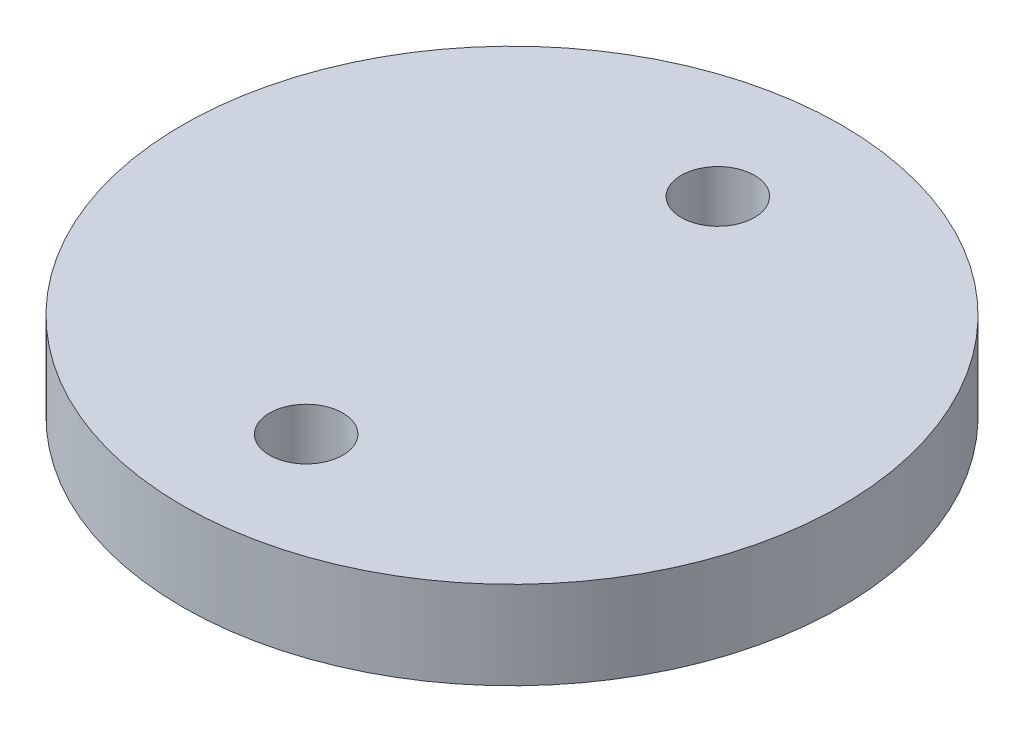
ISO-10303-21;
HEADER;
FILE_DESCRIPTION(('STEP AP214'),'2;1');
FILE_NAME('part.step','',(''),(''),'','','');
FILE_SCHEMA(('AUTOMOTIVE_DESIGN { 1 0 10303 214 1 1 1 1 }'));
ENDSEC;
DATA;
#1=APPLICATION_CONTEXT('core data for automotive mechanical design processes');
#2=APPLICATION_PROTOCOL_DEFINITION('international standard','automotive_design',2000,#1);
#3=PRODUCT_CONTEXT('',#1,'mechanical');
#4=PRODUCT('Part','Part','',(#3));
#5=PRODUCT_RELATED_PRODUCT_CATEGORY('part','',(#4));
#6=PRODUCT_DEFINITION_FORMATION('','',#4);
#7=PRODUCT_DEFINITION_CONTEXT('part definition',#1,'design');
#8=PRODUCT_DEFINITION('design','',#6,#7);
#9=PRODUCT_DEFINITION_SHAPE('','',#8);
#10=(LENGTH_UNIT() NAMED_UNIT(*) SI_UNIT(.MILLI.,.METRE.));
#11=(NAMED_UNIT(*) PLANE_ANGLE_UNIT() SI_UNIT($,.RADIAN.));
#12=(NAMED_UNIT(*) SI_UNIT($,.STERADIAN.) SOLID_ANGLE_UNIT());
#13=UNCERTAINTY_MEASURE_WITH_UNIT(LENGTH_MEASURE(1.E-05),#10,'distance_accuracy_value','');
#14=(GEOMETRIC_REPRESENTATION_CONTEXT(3) GLOBAL_UNCERTAINTY_ASSIGNED_CONTEXT((#13)) GLOBAL_UNIT_ASSIGNED_CONTEXT((#10,
#11,#12)) REPRESENTATION_CONTEXT('',''));
#15=CARTESIAN_POINT('',(0.,0.,0.));
#16=DIRECTION('',(0.,0.,1.));
#17=DIRECTION('',(1.,0.,0.));
#18=AXIS2_PLACEMENT_3D('',#15,#16,#17);
#19=CARTESIAN_POINT('',(0.,3.048,0.));
#20=DIRECTION('',(0.,1.,0.));
#21=DIRECTION('',(0.,0.,1.));
#22=AXIS2_PLACEMENT_3D('',#19,#20,#21);
#23=PLANE('',#22);
#24=CARTESIAN_POINT('',(0.,3.048,-7.139305));
#25=DIRECTION('',(0.,1.,0.));
#26=DIRECTION('',(0.,0.,1.));
#27=AXIS2_PLACEMENT_3D('',#24,#25,#26);
#28=CIRCLE('',#27,1.27);
#29=CARTESIAN_POINT('',(0.,3.048,-5.869305));
#30=VERTEX_POINT('',#29);
#31=EDGE_CURVE('E42',#30,#30,#28,.T.);
#32=ORIENTED_EDGE('',*,*,#31,.F.);
#33=EDGE_LOOP('',(#32));
#34=FACE_BOUND('',#33,.T.);
#35=CARTESIAN_POINT('',(0.,3.048,0.));
#36=DIRECTION('',(0.,1.,0.));
#37=DIRECTION('',(0.,0.,1.));
#38=AXIS2_PLACEMENT_3D('',#35,#36,#37);
#39=CIRCLE('',#38,11.43);
#40=CARTESIAN_POINT('',(0.,3.048,11.43));
#41=VERTEX_POINT('',#40);
#42=EDGE_CURVE('E10',#41,#41,#39,.T.);
#43=ORIENTED_EDGE('',*,*,#42,.T.);
#44=EDGE_LOOP('',(#43));
#45=FACE_BOUND('',#44,.T.);
#46=CARTESIAN_POINT('',(0.,3.048,7.139305));
#47=DIRECTION('',(0.,1.,0.));
#48=DIRECTION('',(0.,0.,1.));
#49=AXIS2_PLACEMENT_3D('',#46,#47,#48);
#50=CIRCLE('',#49,1.27);
#51=CARTESIAN_POINT('',(0.,3.048,8.409305));
#52=VERTEX_POINT('',#51);
#53=EDGE_CURVE('E47',#52,#52,#50,.T.);
#54=ORIENTED_EDGE('',*,*,#53,.F.);
#55=EDGE_LOOP('',(#54));
#56=FACE_BOUND('',#55,.T.);
#57=ADVANCED_FACE('F31',(#34,#45,#56),#23,.T.);
#58=CARTESIAN_POINT('',(0.,0.,0.));
#59=DIRECTION('',(0.,1.,0.));
#60=DIRECTION('',(0.,0.,1.));
#61=AXIS2_PLACEMENT_3D('',#58,#59,#60);
#62=PLANE('',#61);
#63=CARTESIAN_POINT('',(0.,0.,-7.139305));
#64=DIRECTION('',(0.,1.,0.));
#65=DIRECTION('',(0.,0.,1.));
#66=AXIS2_PLACEMENT_3D('',#63,#64,#65);
#67=CIRCLE('',#66,1.27);
#68=CARTESIAN_POINT('',(0.,0.,-5.869305));
#69=VERTEX_POINT('',#68);
#70=EDGE_CURVE('E44',#69,#69,#67,.T.);
#71=ORIENTED_EDGE('',*,*,#70,.T.);
#72=EDGE_LOOP('',(#71));
#73=FACE_BOUND('',#72,.T.);
#74=CARTESIAN_POINT('',(0.,0.,0.));
#75=DIRECTION('',(0.,1.,0.));
#76=DIRECTION('',(0.,0.,1.));
#77=AXIS2_PLACEMENT_3D('',#74,#75,#76);
#78=CIRCLE('',#77,11.43);
#79=CARTESIAN_POINT('',(0.,0.,11.43));
#80=VERTEX_POINT('',#79);
#81=EDGE_CURVE('E35',#80,#80,#78,.T.);
#82=ORIENTED_EDGE('',*,*,#81,.F.);
#83=EDGE_LOOP('',(#82));
#84=FACE_BOUND('',#83,.T.);
#85=CARTESIAN_POINT('',(0.,0.,7.139305));
#86=DIRECTION('',(0.,1.,0.));
#87=DIRECTION('',(0.,0.,1.));
#88=AXIS2_PLACEMENT_3D('',#85,#86,#87);
#89=CIRCLE('',#88,1.27);
#90=CARTESIAN_POINT('',(0.,0.,8.409305));
#91=VERTEX_POINT('',#90);
#92=EDGE_CURVE('E50',#91,#91,#89,.T.);
#93=ORIENTED_EDGE('',*,*,#92,.T.);
#94=EDGE_LOOP('',(#93));
#95=FACE_BOUND('',#94,.T.);
#96=ADVANCED_FACE('F60',(#73,#84,#95),#62,.F.);
#97=CARTESIAN_POINT('',(0.,3.048,0.));
#98=DIRECTION('',(0.,-1.,0.));
#99=DIRECTION('',(0.,0.,-1.));
#100=AXIS2_PLACEMENT_3D('',#97,#98,#99);
#101=CYLINDRICAL_SURFACE('',#100,11.43);
#102=ORIENTED_EDGE('',*,*,#42,.F.);
#103=EDGE_LOOP('',(#102));
#104=FACE_BOUND('',#103,.T.);
#105=ORIENTED_EDGE('',*,*,#81,.T.);
#106=EDGE_LOOP('',(#105));
#107=FACE_BOUND('',#106,.T.);
#108=ADVANCED_FACE('F33',(#104,#107),#101,.T.);
#109=CARTESIAN_POINT('',(0.,3.048,-7.139305));
#110=DIRECTION('',(0.,-1.,0.));
#111=DIRECTION('',(0.,0.,-1.));
#112=AXIS2_PLACEMENT_3D('',#109,#110,#111);
#113=CYLINDRICAL_SURFACE('',#112,1.27);
#114=ORIENTED_EDGE('',*,*,#31,.T.);
#115=EDGE_LOOP('',(#114));
#116=FACE_BOUND('',#115,.T.);
#117=ORIENTED_EDGE('',*,*,#70,.F.);
#118=EDGE_LOOP('',(#117));
#119=FACE_BOUND('',#118,.T.);
#120=ADVANCED_FACE('F69',(#116,#119),#113,.F.);
#121=CARTESIAN_POINT('',(0.,3.048,7.139305));
#122=DIRECTION('',(0.,-1.,0.));
#123=DIRECTION('',(0.,0.,-1.));
#124=AXIS2_PLACEMENT_3D('',#121,#122,#123);
#125=CYLINDRICAL_SURFACE('',#124,1.27);
#126=ORIENTED_EDGE('',*,*,#53,.T.);
#127=EDGE_LOOP('',(#126));
#128=FACE_BOUND('',#127,.T.);
#129=ORIENTED_EDGE('',*,*,#92,.F.);
#130=EDGE_LOOP('',(#129));
#131=FACE_BOUND('',#130,.T.);
#132=ADVANCED_FACE('F56',(#128,#131),#125,.F.);
#133=CLOSED_SHELL('',(#57,#96,#108,#120,#132));
#134=MANIFOLD_SOLID_BREP('B2',#133);
#135=ADVANCED_BREP_SHAPE_REPRESENTATION('',(#18,#134),#14);
#136=SHAPE_DEFINITION_REPRESENTATION(#9,#135);
ENDSEC;
END-ISO-10303-21;
